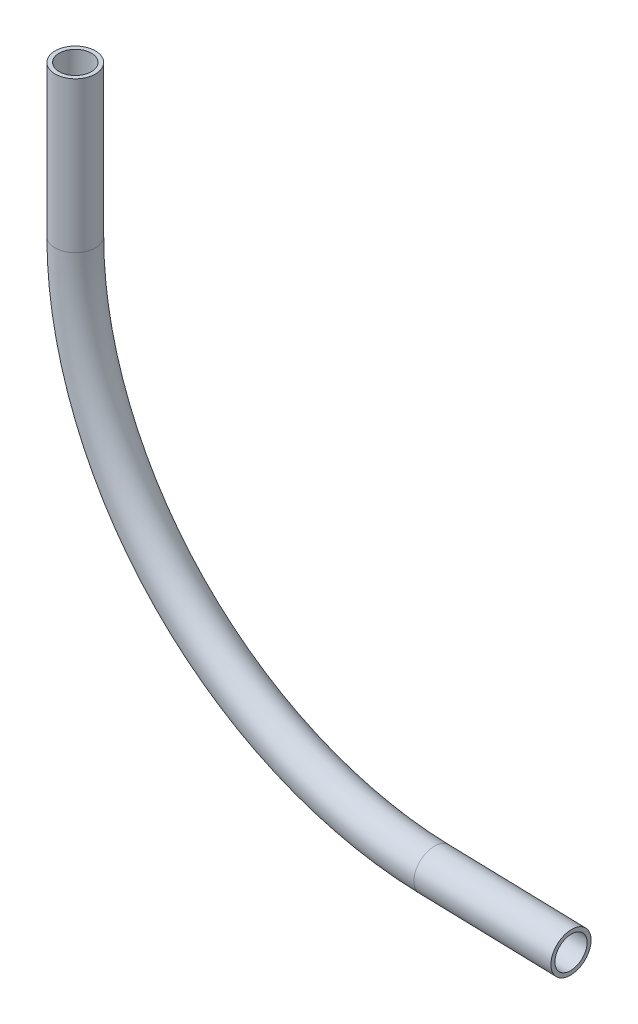
ISO-10303-21;
HEADER;
FILE_DESCRIPTION(('STEP AP214'),'2;1');
FILE_NAME('part.step','',(''),(''),'','','');
FILE_SCHEMA(('AUTOMOTIVE_DESIGN { 1 0 10303 214 1 1 1 1 }'));
ENDSEC;
DATA;
#1=APPLICATION_CONTEXT('core data for automotive mechanical design processes');
#2=APPLICATION_PROTOCOL_DEFINITION('international standard','automotive_design',2000,#1);
#3=PRODUCT_CONTEXT('',#1,'mechanical');
#4=PRODUCT('Part','Part','',(#3));
#5=PRODUCT_RELATED_PRODUCT_CATEGORY('part','',(#4));
#6=PRODUCT_DEFINITION_FORMATION('','',#4);
#7=PRODUCT_DEFINITION_CONTEXT('part definition',#1,'design');
#8=PRODUCT_DEFINITION('design','',#6,#7);
#9=PRODUCT_DEFINITION_SHAPE('','',#8);
#10=(LENGTH_UNIT() NAMED_UNIT(*) SI_UNIT(.MILLI.,.METRE.));
#11=(NAMED_UNIT(*) PLANE_ANGLE_UNIT() SI_UNIT($,.RADIAN.));
#12=(NAMED_UNIT(*) SI_UNIT($,.STERADIAN.) SOLID_ANGLE_UNIT());
#13=UNCERTAINTY_MEASURE_WITH_UNIT(LENGTH_MEASURE(1.E-05),#10,'distance_accuracy_value','');
#14=(GEOMETRIC_REPRESENTATION_CONTEXT(3) GLOBAL_UNCERTAINTY_ASSIGNED_CONTEXT((#13)) GLOBAL_UNIT_ASSIGNED_CONTEXT((#10,
#11,#12)) REPRESENTATION_CONTEXT('',''));
#15=CARTESIAN_POINT('',(0.,0.,0.));
#16=DIRECTION('',(0.,0.,1.));
#17=DIRECTION('',(1.,0.,0.));
#18=AXIS2_PLACEMENT_3D('',#15,#16,#17);
#19=CARTESIAN_POINT('',(0.,107.830938620693,0.));
#20=DIRECTION('',(0.,1.,0.));
#21=DIRECTION('',(0.,0.,1.));
#22=AXIS2_PLACEMENT_3D('',#19,#20,#21);
#23=CYLINDRICAL_SURFACE('',#22,3.81);
#24=CARTESIAN_POINT('',(0.,110.370938620693,0.));
#25=DIRECTION('',(0.,1.,0.));
#26=DIRECTION('',(0.,0.,1.));
#27=AXIS2_PLACEMENT_3D('',#24,#25,#26);
#28=CIRCLE('',#27,3.81);
#29=CARTESIAN_POINT('',(0.,110.370938620693,3.81));
#30=VERTEX_POINT('',#29);
#31=EDGE_CURVE('E10',#30,#30,#28,.T.);
#32=ORIENTED_EDGE('',*,*,#31,.F.);
#33=EDGE_LOOP('',(#32));
#34=FACE_BOUND('',#33,.T.);
#35=CARTESIAN_POINT('',(0.,81.8399496835882,0.));
#36=DIRECTION('',(0.,1.,0.));
#37=DIRECTION('',(0.,0.,1.));
#38=AXIS2_PLACEMENT_3D('',#35,#36,#37);
#39=CIRCLE('',#38,3.81);
#40=CARTESIAN_POINT('',(-3.80999999999999,81.8399496835882,0.));
#41=VERTEX_POINT('',#40);
#42=EDGE_CURVE('E55',#41,#41,#39,.T.);
#43=ORIENTED_EDGE('',*,*,#42,.T.);
#44=EDGE_LOOP('',(#43));
#45=FACE_BOUND('',#44,.T.);
#46=ADVANCED_FACE('F30',(#34,#45),#23,.T.);
#47=CARTESIAN_POINT('',(0.,110.370938620693,0.));
#48=DIRECTION('',(0.,1.,0.));
#49=DIRECTION('',(0.,0.,1.));
#50=AXIS2_PLACEMENT_3D('',#47,#48,#49);
#51=PLANE('',#50);
#52=CARTESIAN_POINT('',(0.,110.370938620693,0.));
#53=DIRECTION('',(0.,1.,0.));
#54=DIRECTION('',(0.,0.,1.));
#55=AXIS2_PLACEMENT_3D('',#52,#53,#54);
#56=CIRCLE('',#55,3.048);
#57=CARTESIAN_POINT('',(0.,110.370938620693,3.048));
#58=VERTEX_POINT('',#57);
#59=EDGE_CURVE('E36',#58,#58,#56,.T.);
#60=ORIENTED_EDGE('',*,*,#59,.F.);
#61=EDGE_LOOP('',(#60));
#62=FACE_BOUND('',#61,.T.);
#63=ORIENTED_EDGE('',*,*,#31,.T.);
#64=EDGE_LOOP('',(#63));
#65=FACE_BOUND('',#64,.T.);
#66=ADVANCED_FACE('F68',(#62,#65),#51,.T.);
#67=CARTESIAN_POINT('',(0.,107.830938620693,0.));
#68=DIRECTION('',(0.,1.,0.));
#69=DIRECTION('',(0.,0.,1.));
#70=AXIS2_PLACEMENT_3D('',#67,#68,#69);
#71=CYLINDRICAL_SURFACE('',#70,3.048);
#72=ORIENTED_EDGE('',*,*,#59,.T.);
#73=EDGE_LOOP('',(#72));
#74=FACE_BOUND('',#73,.T.);
#75=CARTESIAN_POINT('',(0.,81.8399496835882,0.));
#76=DIRECTION('',(0.,1.,0.));
#77=DIRECTION('',(0.,0.,1.));
#78=AXIS2_PLACEMENT_3D('',#75,#76,#77);
#79=CIRCLE('',#78,3.048);
#80=CARTESIAN_POINT('',(-3.048,81.8399496835882,0.));
#81=VERTEX_POINT('',#80);
#82=EDGE_CURVE('E58',#81,#81,#79,.T.);
#83=ORIENTED_EDGE('',*,*,#82,.F.);
#84=EDGE_LOOP('',(#83));
#85=FACE_BOUND('',#84,.T.);
#86=ADVANCED_FACE('F65',(#74,#85),#71,.F.);
#87=CARTESIAN_POINT('',(67.9642292628344,12.0154098087931,0.));
#88=DIRECTION('',(0.999635502860345,-0.0269974336029433,0.));
#89=DIRECTION('',(0.0269974336029433,0.999635502860345,0.));
#90=AXIS2_PLACEMENT_3D('',#87,#88,#89);
#91=CYLINDRICAL_SURFACE('',#90,3.81);
#92=CARTESIAN_POINT('',(67.9642292628344,12.0154098087931,0.));
#93=DIRECTION('',(-0.999635502860345,0.0269974336029436,0.));
#94=DIRECTION('',(0.,0.,1.));
#95=AXIS2_PLACEMENT_3D('',#92,#93,#94);
#96=CIRCLE('',#95,3.81);
#97=CARTESIAN_POINT('',(67.8613690408072,8.20679854289515,0.));
#98=VERTEX_POINT('',#97);
#99=EDGE_CURVE('E49',#98,#98,#96,.T.);
#100=ORIENTED_EDGE('',*,*,#99,.F.);
#101=EDGE_LOOP('',(#100));
#102=FACE_BOUND('',#101,.T.);
#103=CARTESIAN_POINT('',(93.926499612434,11.3142395642996,0.));
#104=DIRECTION('',(-0.999635502860345,0.0269974336029436,0.));
#105=DIRECTION('',(0.,0.,1.));
#106=AXIS2_PLACEMENT_3D('',#103,#104,#105);
#107=CIRCLE('',#106,3.81);
#108=CARTESIAN_POINT('',(93.926499612434,11.3142395642996,3.81));
#109=VERTEX_POINT('',#108);
#110=EDGE_CURVE('E40',#109,#109,#107,.T.);
#111=ORIENTED_EDGE('',*,*,#110,.T.);
#112=EDGE_LOOP('',(#111));
#113=FACE_BOUND('',#112,.T.);
#114=ADVANCED_FACE('F67',(#102,#113),#91,.T.);
#115=CARTESIAN_POINT('',(67.9642292628344,12.0154098087931,0.));
#116=DIRECTION('',(0.999635502860345,-0.0269974336029433,0.));
#117=DIRECTION('',(0.0269974336029433,0.999635502860345,0.));
#118=AXIS2_PLACEMENT_3D('',#115,#116,#117);
#119=CYLINDRICAL_SURFACE('',#118,3.048);
#120=CARTESIAN_POINT('',(67.9642292628344,12.0154098087931,0.));
#121=DIRECTION('',(-0.999635502860345,0.0269974336029436,0.));
#122=DIRECTION('',(0.,0.,1.));
#123=AXIS2_PLACEMENT_3D('',#120,#121,#122);
#124=CIRCLE('',#123,3.048);
#125=CARTESIAN_POINT('',(67.8819410852126,8.96852079607474,0.));
#126=VERTEX_POINT('',#125);
#127=EDGE_CURVE('E52',#126,#126,#124,.T.);
#128=ORIENTED_EDGE('',*,*,#127,.T.);
#129=EDGE_LOOP('',(#128));
#130=FACE_BOUND('',#129,.T.);
#131=CARTESIAN_POINT('',(93.926499612434,11.3142395642996,0.));
#132=DIRECTION('',(-0.999635502860345,0.0269974336029436,0.));
#133=DIRECTION('',(0.,0.,1.));
#134=AXIS2_PLACEMENT_3D('',#131,#132,#133);
#135=CIRCLE('',#134,3.048);
#136=CARTESIAN_POINT('',(93.926499612434,11.3142395642996,3.048));
#137=VERTEX_POINT('',#136);
#138=EDGE_CURVE('E44',#137,#137,#135,.T.);
#139=ORIENTED_EDGE('',*,*,#138,.F.);
#140=EDGE_LOOP('',(#139));
#141=FACE_BOUND('',#140,.T.);
#142=ADVANCED_FACE('F74',(#130,#141),#119,.F.);
#143=CARTESIAN_POINT('',(69.85,81.8399496835882,0.));
#144=DIRECTION('',(0.,0.,1.));
#145=DIRECTION('',(1.,0.,0.));
#146=AXIS2_PLACEMENT_3D('',#143,#144,#145);
#147=TOROIDAL_SURFACE('',#146,69.85,3.81);
#148=CARTESIAN_POINT('',(69.85,81.8399496835882,0.));
#149=DIRECTION('',(0.,0.,1.));
#150=DIRECTION('',(1.,0.,0.));
#151=AXIS2_PLACEMENT_3D('',#148,#149,#150);
#152=CIRCLE('',#151,73.66);
#153=EDGE_CURVE('',#41,#98,#152,.T.);
#154=ORIENTED_EDGE('',*,*,#42,.F.);
#155=ORIENTED_EDGE('',*,*,#99,.T.);
#156=ORIENTED_EDGE('',*,*,#153,.T.);
#157=ORIENTED_EDGE('',*,*,#153,.F.);
#158=EDGE_LOOP('',(#154,#156,#155,#157));
#159=FACE_BOUND('',#158,.T.);
#160=ADVANCED_FACE('F85',(#159),#147,.T.);
#161=CARTESIAN_POINT('',(69.85,81.8399496835882,0.));
#162=DIRECTION('',(0.,0.,1.));
#163=DIRECTION('',(1.,0.,0.));
#164=AXIS2_PLACEMENT_3D('',#161,#162,#163);
#165=TOROIDAL_SURFACE('',#164,69.85,3.048);
#166=CARTESIAN_POINT('',(69.85,81.8399496835882,0.));
#167=DIRECTION('',(0.,0.,1.));
#168=DIRECTION('',(1.,0.,0.));
#169=AXIS2_PLACEMENT_3D('',#166,#167,#168);
#170=CIRCLE('',#169,72.898);
#171=EDGE_CURVE('',#81,#126,#170,.T.);
#172=ORIENTED_EDGE('',*,*,#82,.T.);
#173=ORIENTED_EDGE('',*,*,#127,.F.);
#174=ORIENTED_EDGE('',*,*,#171,.T.);
#175=ORIENTED_EDGE('',*,*,#171,.F.);
#176=EDGE_LOOP('',(#172,#174,#173,#175));
#177=FACE_BOUND('',#176,.T.);
#178=ADVANCED_FACE('F62',(#177),#165,.F.);
#179=CARTESIAN_POINT('',(93.926499612434,11.3142395642996,0.));
#180=DIRECTION('',(-0.999635502860345,0.0269974336029436,0.));
#181=DIRECTION('',(0.,0.,1.));
#182=AXIS2_PLACEMENT_3D('',#179,#180,#181);
#183=PLANE('',#182);
#184=ORIENTED_EDGE('',*,*,#138,.T.);
#185=EDGE_LOOP('',(#184));
#186=FACE_BOUND('',#185,.T.);
#187=ORIENTED_EDGE('',*,*,#110,.F.);
#188=EDGE_LOOP('',(#187));
#189=FACE_BOUND('',#188,.T.);
#190=ADVANCED_FACE('F93',(#186,#189),#183,.F.);
#191=CLOSED_SHELL('',(#46,#66,#86,#114,#142,#160,#178,#190));
#192=MANIFOLD_SOLID_BREP('B2',#191);
#193=ADVANCED_BREP_SHAPE_REPRESENTATION('',(#18,#192),#14);
#194=SHAPE_DEFINITION_REPRESENTATION(#9,#193);
ENDSEC;
END-ISO-10303-21;
